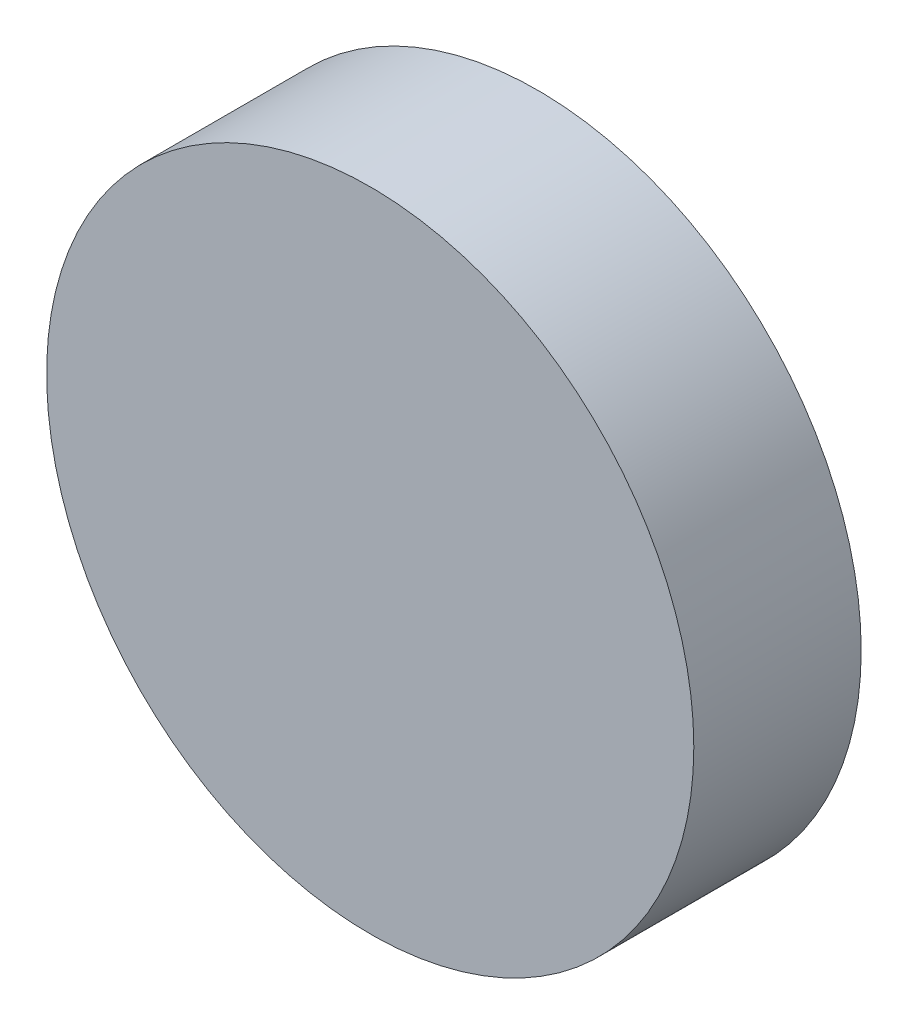
ISO-10303-21;
HEADER;
FILE_DESCRIPTION(('STEP AP214'),'2;1');
FILE_NAME('part.step','',(''),(''),'','','');
FILE_SCHEMA(('AUTOMOTIVE_DESIGN { 1 0 10303 214 1 1 1 1 }'));
ENDSEC;
DATA;
#1=APPLICATION_CONTEXT('core data for automotive mechanical design processes');
#2=APPLICATION_PROTOCOL_DEFINITION('international standard','automotive_design',2000,#1);
#3=PRODUCT_CONTEXT('',#1,'mechanical');
#4=PRODUCT('Part','Part','',(#3));
#5=PRODUCT_RELATED_PRODUCT_CATEGORY('part','',(#4));
#6=PRODUCT_DEFINITION_FORMATION('','',#4);
#7=PRODUCT_DEFINITION_CONTEXT('part definition',#1,'design');
#8=PRODUCT_DEFINITION('design','',#6,#7);
#9=PRODUCT_DEFINITION_SHAPE('','',#8);
#10=(LENGTH_UNIT() NAMED_UNIT(*) SI_UNIT(.MILLI.,.METRE.));
#11=(NAMED_UNIT(*) PLANE_ANGLE_UNIT() SI_UNIT($,.RADIAN.));
#12=(NAMED_UNIT(*) SI_UNIT($,.STERADIAN.) SOLID_ANGLE_UNIT());
#13=UNCERTAINTY_MEASURE_WITH_UNIT(LENGTH_MEASURE(1.E-05),#10,'distance_accuracy_value','');
#14=(GEOMETRIC_REPRESENTATION_CONTEXT(3) GLOBAL_UNCERTAINTY_ASSIGNED_CONTEXT((#13)) GLOBAL_UNIT_ASSIGNED_CONTEXT((#10,
#11,#12)) REPRESENTATION_CONTEXT('',''));
#15=CARTESIAN_POINT('',(0.,0.,0.));
#16=DIRECTION('',(0.,0.,1.));
#17=DIRECTION('',(1.,0.,0.));
#18=AXIS2_PLACEMENT_3D('',#15,#16,#17);
#19=CARTESIAN_POINT('',(0.,0.,15.));
#20=DIRECTION('',(0.,0.,-1.));
#21=DIRECTION('',(-1.,0.,0.));
#22=AXIS2_PLACEMENT_3D('',#19,#20,#21);
#23=CYLINDRICAL_SURFACE('',#22,29.);
#24=CARTESIAN_POINT('',(0.,0.,15.));
#25=DIRECTION('',(0.,0.,1.));
#26=DIRECTION('',(1.,0.,0.));
#27=AXIS2_PLACEMENT_3D('',#24,#25,#26);
#28=CIRCLE('',#27,29.);
#29=CARTESIAN_POINT('',(29.,0.,15.));
#30=VERTEX_POINT('',#29);
#31=EDGE_CURVE('E10',#30,#30,#28,.T.);
#32=ORIENTED_EDGE('',*,*,#31,.F.);
#33=EDGE_LOOP('',(#32));
#34=FACE_BOUND('',#33,.T.);
#35=CARTESIAN_POINT('',(0.,0.,0.));
#36=DIRECTION('',(0.,0.,1.));
#37=DIRECTION('',(1.,0.,0.));
#38=AXIS2_PLACEMENT_3D('',#35,#36,#37);
#39=CIRCLE('',#38,29.);
#40=CARTESIAN_POINT('',(29.,0.,0.));
#41=VERTEX_POINT('',#40);
#42=EDGE_CURVE('E42',#41,#41,#39,.T.);
#43=ORIENTED_EDGE('',*,*,#42,.T.);
#44=EDGE_LOOP('',(#43));
#45=FACE_BOUND('',#44,.T.);
#46=ADVANCED_FACE('F39',(#34,#45),#23,.T.);
#47=CARTESIAN_POINT('',(0.,0.,15.));
#48=DIRECTION('',(0.,0.,1.));
#49=DIRECTION('',(1.,0.,0.));
#50=AXIS2_PLACEMENT_3D('',#47,#48,#49);
#51=PLANE('',#50);
#52=ORIENTED_EDGE('',*,*,#31,.T.);
#53=EDGE_LOOP('',(#52));
#54=FACE_BOUND('',#53,.T.);
#55=ADVANCED_FACE('F56',(#54),#51,.T.);
#56=CARTESIAN_POINT('',(0.,0.,0.));
#57=DIRECTION('',(0.,0.,1.));
#58=DIRECTION('',(1.,0.,0.));
#59=AXIS2_PLACEMENT_3D('',#56,#57,#58);
#60=PLANE('',#59);
#61=ORIENTED_EDGE('',*,*,#42,.F.);
#62=EDGE_LOOP('',(#61));
#63=FACE_BOUND('',#62,.T.);
#64=ADVANCED_FACE('F54',(#63),#60,.F.);
#65=CLOSED_SHELL('',(#46,#55,#64));
#66=MANIFOLD_SOLID_BREP('B2',#65);
#67=ADVANCED_BREP_SHAPE_REPRESENTATION('',(#18,#66),#14);
#68=SHAPE_DEFINITION_REPRESENTATION(#9,#67);
ENDSEC;
END-ISO-10303-21;
